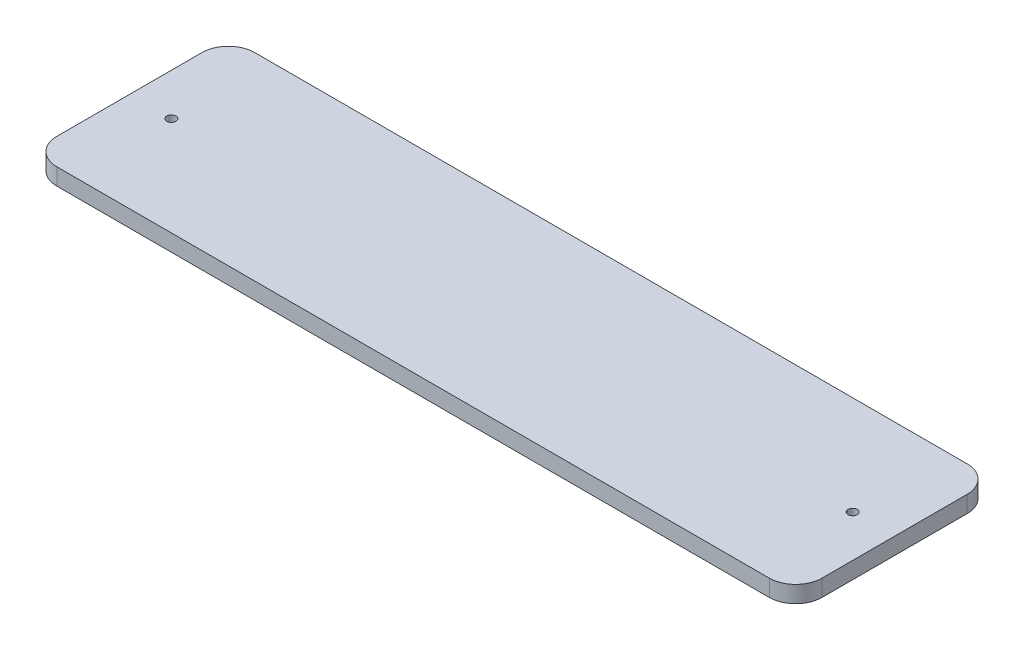
ISO-10303-21;
HEADER;
FILE_DESCRIPTION(('STEP AP214'),'2;1');
FILE_NAME('part.step','',(''),(''),'','','');
FILE_SCHEMA(('AUTOMOTIVE_DESIGN { 1 0 10303 214 1 1 1 1 }'));
ENDSEC;
DATA;
#1=APPLICATION_CONTEXT('core data for automotive mechanical design processes');
#2=APPLICATION_PROTOCOL_DEFINITION('international standard','automotive_design',2000,#1);
#3=PRODUCT_CONTEXT('',#1,'mechanical');
#4=PRODUCT('Part','Part','',(#3));
#5=PRODUCT_RELATED_PRODUCT_CATEGORY('part','',(#4));
#6=PRODUCT_DEFINITION_FORMATION('','',#4);
#7=PRODUCT_DEFINITION_CONTEXT('part definition',#1,'design');
#8=PRODUCT_DEFINITION('design','',#6,#7);
#9=PRODUCT_DEFINITION_SHAPE('','',#8);
#10=(LENGTH_UNIT() NAMED_UNIT(*) SI_UNIT(.MILLI.,.METRE.));
#11=(NAMED_UNIT(*) PLANE_ANGLE_UNIT() SI_UNIT($,.RADIAN.));
#12=(NAMED_UNIT(*) SI_UNIT($,.STERADIAN.) SOLID_ANGLE_UNIT());
#13=UNCERTAINTY_MEASURE_WITH_UNIT(LENGTH_MEASURE(1.E-05),#10,'distance_accuracy_value','');
#14=(GEOMETRIC_REPRESENTATION_CONTEXT(3) GLOBAL_UNCERTAINTY_ASSIGNED_CONTEXT((#13)) GLOBAL_UNIT_ASSIGNED_CONTEXT((#10,
#11,#12)) REPRESENTATION_CONTEXT('',''));
#15=CARTESIAN_POINT('',(0.,0.,0.));
#16=DIRECTION('',(0.,0.,1.));
#17=DIRECTION('',(1.,0.,0.));
#18=AXIS2_PLACEMENT_3D('',#15,#16,#17);
#19=CARTESIAN_POINT('',(145.,6.35,-37.5));
#20=DIRECTION('',(-1.,0.,0.));
#21=DIRECTION('',(0.,0.,1.));
#22=AXIS2_PLACEMENT_3D('',#19,#20,#21);
#23=PLANE('',#22);
#24=DIRECTION('',(0.,0.,-1.));
#25=VECTOR('',#24,1.);
#26=CARTESIAN_POINT('',(145.,0.,-37.5));
#27=LINE('',#26,#25);
#28=CARTESIAN_POINT('',(145.,0.,27.5));
#29=VERTEX_POINT('',#28);
#30=CARTESIAN_POINT('',(145.,0.,-27.5));
#31=VERTEX_POINT('',#30);
#32=EDGE_CURVE('E126',#29,#31,#27,.T.);
#33=ORIENTED_EDGE('',*,*,#32,.T.);
#34=DIRECTION('',(0.,-1.,0.));
#35=VECTOR('',#34,1.);
#36=CARTESIAN_POINT('',(145.,6.35,-27.5));
#37=LINE('',#36,#35);
#38=CARTESIAN_POINT('',(145.,6.35,-27.5));
#39=VERTEX_POINT('',#38);
#40=EDGE_CURVE('E104',#31,#39,#37,.F.);
#41=ORIENTED_EDGE('',*,*,#40,.T.);
#42=DIRECTION('',(0.,0.,-1.));
#43=VECTOR('',#42,1.);
#44=CARTESIAN_POINT('',(145.,6.35,-37.5));
#45=LINE('',#44,#43);
#46=CARTESIAN_POINT('',(145.,6.35,27.5));
#47=VERTEX_POINT('',#46);
#48=EDGE_CURVE('E136',#47,#39,#45,.T.);
#49=ORIENTED_EDGE('',*,*,#48,.F.);
#50=DIRECTION('',(0.,-1.,0.));
#51=VECTOR('',#50,1.);
#52=CARTESIAN_POINT('',(145.,6.35,27.5));
#53=LINE('',#52,#51);
#54=EDGE_CURVE('E109',#47,#29,#53,.T.);
#55=ORIENTED_EDGE('',*,*,#54,.T.);
#56=EDGE_LOOP('',(#33,#41,#49,#55));
#57=FACE_BOUND('',#56,.T.);
#58=ADVANCED_FACE('F33',(#57),#23,.F.);
#59=CARTESIAN_POINT('',(-145.,6.35,-37.5));
#60=DIRECTION('',(0.,0.,1.));
#61=DIRECTION('',(1.,0.,0.));
#62=AXIS2_PLACEMENT_3D('',#59,#60,#61);
#63=PLANE('',#62);
#64=DIRECTION('',(-1.,0.,0.));
#65=VECTOR('',#64,1.);
#66=CARTESIAN_POINT('',(-145.,6.35,-37.5));
#67=LINE('',#66,#65);
#68=CARTESIAN_POINT('',(135.,6.35,-37.5));
#69=VERTEX_POINT('',#68);
#70=CARTESIAN_POINT('',(-135.,6.35,-37.5));
#71=VERTEX_POINT('',#70);
#72=EDGE_CURVE('E119',#69,#71,#67,.T.);
#73=ORIENTED_EDGE('',*,*,#72,.F.);
#74=DIRECTION('',(0.,-1.,0.));
#75=VECTOR('',#74,1.);
#76=CARTESIAN_POINT('',(135.,6.35,-37.5));
#77=LINE('',#76,#75);
#78=CARTESIAN_POINT('',(135.,0.,-37.5));
#79=VERTEX_POINT('',#78);
#80=EDGE_CURVE('E103',#69,#79,#77,.T.);
#81=ORIENTED_EDGE('',*,*,#80,.T.);
#82=DIRECTION('',(-1.,0.,0.));
#83=VECTOR('',#82,1.);
#84=CARTESIAN_POINT('',(-145.,0.,-37.5));
#85=LINE('',#84,#83);
#86=CARTESIAN_POINT('',(-135.,0.,-37.5));
#87=VERTEX_POINT('',#86);
#88=EDGE_CURVE('E116',#79,#87,#85,.T.);
#89=ORIENTED_EDGE('',*,*,#88,.T.);
#90=DIRECTION('',(0.,-1.,0.));
#91=VECTOR('',#90,1.);
#92=CARTESIAN_POINT('',(-135.,6.35,-37.5));
#93=LINE('',#92,#91);
#94=EDGE_CURVE('E121',#87,#71,#93,.F.);
#95=ORIENTED_EDGE('',*,*,#94,.T.);
#96=EDGE_LOOP('',(#73,#81,#89,#95));
#97=FACE_BOUND('',#96,.T.);
#98=ADVANCED_FACE('F115',(#97),#63,.F.);
#99=CARTESIAN_POINT('',(-145.,6.35,-37.5));
#100=DIRECTION('',(1.,0.,0.));
#101=DIRECTION('',(0.,0.,-1.));
#102=AXIS2_PLACEMENT_3D('',#99,#100,#101);
#103=PLANE('',#102);
#104=DIRECTION('',(0.,0.,1.));
#105=VECTOR('',#104,1.);
#106=CARTESIAN_POINT('',(-145.,0.,-37.5));
#107=LINE('',#106,#105);
#108=CARTESIAN_POINT('',(-145.,0.,-27.5));
#109=VERTEX_POINT('',#108);
#110=CARTESIAN_POINT('',(-145.,0.,27.5));
#111=VERTEX_POINT('',#110);
#112=EDGE_CURVE('E125',#109,#111,#107,.T.);
#113=ORIENTED_EDGE('',*,*,#112,.T.);
#114=DIRECTION('',(0.,-1.,0.));
#115=VECTOR('',#114,1.);
#116=CARTESIAN_POINT('',(-145.,6.35,27.5));
#117=LINE('',#116,#115);
#118=CARTESIAN_POINT('',(-145.,6.35,27.5));
#119=VERTEX_POINT('',#118);
#120=EDGE_CURVE('E11',#111,#119,#117,.F.);
#121=ORIENTED_EDGE('',*,*,#120,.T.);
#122=DIRECTION('',(0.,0.,1.));
#123=VECTOR('',#122,1.);
#124=CARTESIAN_POINT('',(-145.,6.35,-37.5));
#125=LINE('',#124,#123);
#126=CARTESIAN_POINT('',(-145.,6.35,-27.5));
#127=VERTEX_POINT('',#126);
#128=EDGE_CURVE('E162',#127,#119,#125,.T.);
#129=ORIENTED_EDGE('',*,*,#128,.F.);
#130=DIRECTION('',(0.,-1.,0.));
#131=VECTOR('',#130,1.);
#132=CARTESIAN_POINT('',(-145.,6.35,-27.5));
#133=LINE('',#132,#131);
#134=EDGE_CURVE('E41',#127,#109,#133,.T.);
#135=ORIENTED_EDGE('',*,*,#134,.T.);
#136=EDGE_LOOP('',(#113,#121,#129,#135));
#137=FACE_BOUND('',#136,.T.);
#138=ADVANCED_FACE('F160',(#137),#103,.F.);
#139=CARTESIAN_POINT('',(-145.,6.35,37.5));
#140=DIRECTION('',(0.,0.,-1.));
#141=DIRECTION('',(-1.,0.,0.));
#142=AXIS2_PLACEMENT_3D('',#139,#140,#141);
#143=PLANE('',#142);
#144=DIRECTION('',(1.,0.,0.));
#145=VECTOR('',#144,1.);
#146=CARTESIAN_POINT('',(-145.,0.,37.5));
#147=LINE('',#146,#145);
#148=CARTESIAN_POINT('',(-135.,0.,37.5));
#149=VERTEX_POINT('',#148);
#150=CARTESIAN_POINT('',(135.,0.,37.5));
#151=VERTEX_POINT('',#150);
#152=EDGE_CURVE('E129',#149,#151,#147,.T.);
#153=ORIENTED_EDGE('',*,*,#152,.T.);
#154=DIRECTION('',(0.,-1.,0.));
#155=VECTOR('',#154,1.);
#156=CARTESIAN_POINT('',(135.,6.35,37.5));
#157=LINE('',#156,#155);
#158=CARTESIAN_POINT('',(135.,6.35,37.5));
#159=VERTEX_POINT('',#158);
#160=EDGE_CURVE('E48',#151,#159,#157,.F.);
#161=ORIENTED_EDGE('',*,*,#160,.T.);
#162=DIRECTION('',(1.,0.,0.));
#163=VECTOR('',#162,1.);
#164=CARTESIAN_POINT('',(-145.,6.35,37.5));
#165=LINE('',#164,#163);
#166=CARTESIAN_POINT('',(-135.,6.35,37.5));
#167=VERTEX_POINT('',#166);
#168=EDGE_CURVE('E137',#167,#159,#165,.T.);
#169=ORIENTED_EDGE('',*,*,#168,.F.);
#170=DIRECTION('',(0.,-1.,0.));
#171=VECTOR('',#170,1.);
#172=CARTESIAN_POINT('',(-135.,6.35,37.5));
#173=LINE('',#172,#171);
#174=EDGE_CURVE('E153',#167,#149,#173,.T.);
#175=ORIENTED_EDGE('',*,*,#174,.T.);
#176=EDGE_LOOP('',(#153,#161,#169,#175));
#177=FACE_BOUND('',#176,.T.);
#178=ADVANCED_FACE('F169',(#177),#143,.F.);
#179=CARTESIAN_POINT('',(0.,6.35,0.));
#180=DIRECTION('',(0.,1.,0.));
#181=DIRECTION('',(0.,0.,1.));
#182=AXIS2_PLACEMENT_3D('',#179,#180,#181);
#183=PLANE('',#182);
#184=CARTESIAN_POINT('',(129.12,6.35,0.));
#185=DIRECTION('',(0.,1.,0.));
#186=DIRECTION('',(0.,0.,1.));
#187=AXIS2_PLACEMENT_3D('',#184,#185,#186);
#188=CIRCLE('',#187,1.75000000000001);
#189=CARTESIAN_POINT('',(129.12,6.35,1.75000000000001));
#190=VERTEX_POINT('',#189);
#191=EDGE_CURVE('E182',#190,#190,#188,.T.);
#192=ORIENTED_EDGE('',*,*,#191,.F.);
#193=EDGE_LOOP('',(#192));
#194=FACE_BOUND('',#193,.T.);
#195=CARTESIAN_POINT('',(-129.12,6.35,0.));
#196=DIRECTION('',(0.,1.,0.));
#197=DIRECTION('',(0.,0.,1.));
#198=AXIS2_PLACEMENT_3D('',#195,#196,#197);
#199=CIRCLE('',#198,1.75000000000001);
#200=CARTESIAN_POINT('',(-129.12,6.35,1.75000000000001));
#201=VERTEX_POINT('',#200);
#202=EDGE_CURVE('E176',#201,#201,#199,.T.);
#203=ORIENTED_EDGE('',*,*,#202,.F.);
#204=EDGE_LOOP('',(#203));
#205=FACE_BOUND('',#204,.T.);
#206=ORIENTED_EDGE('',*,*,#48,.T.);
#207=CARTESIAN_POINT('',(135.,6.35,-27.5));
#208=DIRECTION('',(0.,1.,0.));
#209=DIRECTION('',(0.,0.,1.));
#210=AXIS2_PLACEMENT_3D('',#207,#208,#209);
#211=CIRCLE('',#210,10.);
#212=EDGE_CURVE('E151',#39,#69,#211,.T.);
#213=ORIENTED_EDGE('',*,*,#212,.T.);
#214=ORIENTED_EDGE('',*,*,#72,.T.);
#215=CARTESIAN_POINT('',(-135.,6.35,-27.5));
#216=DIRECTION('',(0.,1.,0.));
#217=DIRECTION('',(0.,0.,1.));
#218=AXIS2_PLACEMENT_3D('',#215,#216,#217);
#219=CIRCLE('',#218,10.);
#220=EDGE_CURVE('E146',#71,#127,#219,.T.);
#221=ORIENTED_EDGE('',*,*,#220,.T.);
#222=ORIENTED_EDGE('',*,*,#128,.T.);
#223=CARTESIAN_POINT('',(-135.,6.35,27.5));
#224=DIRECTION('',(0.,1.,0.));
#225=DIRECTION('',(0.,0.,1.));
#226=AXIS2_PLACEMENT_3D('',#223,#224,#225);
#227=CIRCLE('',#226,10.);
#228=EDGE_CURVE('E55',#119,#167,#227,.T.);
#229=ORIENTED_EDGE('',*,*,#228,.T.);
#230=ORIENTED_EDGE('',*,*,#168,.T.);
#231=CARTESIAN_POINT('',(135.,6.35,27.5));
#232=DIRECTION('',(0.,1.,0.));
#233=DIRECTION('',(0.,0.,1.));
#234=AXIS2_PLACEMENT_3D('',#231,#232,#233);
#235=CIRCLE('',#234,10.);
#236=EDGE_CURVE('E149',#159,#47,#235,.T.);
#237=ORIENTED_EDGE('',*,*,#236,.T.);
#238=EDGE_LOOP('',(#206,#213,#214,#221,#222,#229,#230,#237));
#239=FACE_BOUND('',#238,.T.);
#240=ADVANCED_FACE('F197',(#194,#205,#239),#183,.T.);
#241=CARTESIAN_POINT('',(0.,0.,0.));
#242=DIRECTION('',(0.,1.,0.));
#243=DIRECTION('',(0.,0.,1.));
#244=AXIS2_PLACEMENT_3D('',#241,#242,#243);
#245=PLANE('',#244);
#246=CARTESIAN_POINT('',(129.12,0.,0.));
#247=DIRECTION('',(0.,1.,0.));
#248=DIRECTION('',(0.,0.,1.));
#249=AXIS2_PLACEMENT_3D('',#246,#247,#248);
#250=CIRCLE('',#249,1.75000000000001);
#251=CARTESIAN_POINT('',(129.12,0.,1.75000000000001));
#252=VERTEX_POINT('',#251);
#253=EDGE_CURVE('E179',#252,#252,#250,.T.);
#254=ORIENTED_EDGE('',*,*,#253,.T.);
#255=EDGE_LOOP('',(#254));
#256=FACE_BOUND('',#255,.T.);
#257=CARTESIAN_POINT('',(-129.12,0.,0.));
#258=DIRECTION('',(0.,1.,0.));
#259=DIRECTION('',(0.,0.,1.));
#260=AXIS2_PLACEMENT_3D('',#257,#258,#259);
#261=CIRCLE('',#260,1.75000000000001);
#262=CARTESIAN_POINT('',(-129.12,0.,1.75000000000001));
#263=VERTEX_POINT('',#262);
#264=EDGE_CURVE('E131',#263,#263,#261,.T.);
#265=ORIENTED_EDGE('',*,*,#264,.T.);
#266=EDGE_LOOP('',(#265));
#267=FACE_BOUND('',#266,.T.);
#268=ORIENTED_EDGE('',*,*,#88,.F.);
#269=CARTESIAN_POINT('',(135.,0.,-27.5));
#270=DIRECTION('',(0.,1.,0.));
#271=DIRECTION('',(0.,0.,1.));
#272=AXIS2_PLACEMENT_3D('',#269,#270,#271);
#273=CIRCLE('',#272,10.);
#274=EDGE_CURVE('E99',#79,#31,#273,.F.);
#275=ORIENTED_EDGE('',*,*,#274,.T.);
#276=ORIENTED_EDGE('',*,*,#32,.F.);
#277=CARTESIAN_POINT('',(135.,0.,27.5));
#278=DIRECTION('',(0.,1.,0.));
#279=DIRECTION('',(0.,0.,1.));
#280=AXIS2_PLACEMENT_3D('',#277,#278,#279);
#281=CIRCLE('',#280,10.);
#282=EDGE_CURVE('E110',#29,#151,#281,.F.);
#283=ORIENTED_EDGE('',*,*,#282,.T.);
#284=ORIENTED_EDGE('',*,*,#152,.F.);
#285=CARTESIAN_POINT('',(-135.,0.,27.5));
#286=DIRECTION('',(0.,1.,0.));
#287=DIRECTION('',(0.,0.,1.));
#288=AXIS2_PLACEMENT_3D('',#285,#286,#287);
#289=CIRCLE('',#288,10.);
#290=EDGE_CURVE('E140',#149,#111,#289,.F.);
#291=ORIENTED_EDGE('',*,*,#290,.T.);
#292=ORIENTED_EDGE('',*,*,#112,.F.);
#293=CARTESIAN_POINT('',(-135.,0.,-27.5));
#294=DIRECTION('',(0.,1.,0.));
#295=DIRECTION('',(0.,0.,1.));
#296=AXIS2_PLACEMENT_3D('',#293,#294,#295);
#297=CIRCLE('',#296,10.);
#298=EDGE_CURVE('E120',#109,#87,#297,.F.);
#299=ORIENTED_EDGE('',*,*,#298,.T.);
#300=EDGE_LOOP('',(#268,#275,#276,#283,#284,#291,#292,#299));
#301=FACE_BOUND('',#300,.T.);
#302=ADVANCED_FACE('F123',(#256,#267,#301),#245,.F.);
#303=CARTESIAN_POINT('',(-129.12,0.,0.));
#304=DIRECTION('',(0.,1.,0.));
#305=DIRECTION('',(0.,0.,1.));
#306=AXIS2_PLACEMENT_3D('',#303,#304,#305);
#307=CYLINDRICAL_SURFACE('',#306,1.75000000000001);
#308=ORIENTED_EDGE('',*,*,#264,.F.);
#309=EDGE_LOOP('',(#308));
#310=FACE_BOUND('',#309,.T.);
#311=ORIENTED_EDGE('',*,*,#202,.T.);
#312=EDGE_LOOP('',(#311));
#313=FACE_BOUND('',#312,.T.);
#314=ADVANCED_FACE('F193',(#310,#313),#307,.F.);
#315=CARTESIAN_POINT('',(129.12,0.,0.));
#316=DIRECTION('',(0.,1.,0.));
#317=DIRECTION('',(0.,0.,1.));
#318=AXIS2_PLACEMENT_3D('',#315,#316,#317);
#319=CYLINDRICAL_SURFACE('',#318,1.75000000000001);
#320=ORIENTED_EDGE('',*,*,#253,.F.);
#321=EDGE_LOOP('',(#320));
#322=FACE_BOUND('',#321,.T.);
#323=ORIENTED_EDGE('',*,*,#191,.T.);
#324=EDGE_LOOP('',(#323));
#325=FACE_BOUND('',#324,.T.);
#326=ADVANCED_FACE('F190',(#322,#325),#319,.F.);
#327=CARTESIAN_POINT('',(135.,6.35,-27.5));
#328=DIRECTION('',(0.,-1.,0.));
#329=DIRECTION('',(0.,0.,-1.));
#330=AXIS2_PLACEMENT_3D('',#327,#328,#329);
#331=CYLINDRICAL_SURFACE('',#330,10.);
#332=ORIENTED_EDGE('',*,*,#212,.F.);
#333=ORIENTED_EDGE('',*,*,#40,.F.);
#334=ORIENTED_EDGE('',*,*,#274,.F.);
#335=ORIENTED_EDGE('',*,*,#80,.F.);
#336=EDGE_LOOP('',(#332,#333,#334,#335));
#337=FACE_BOUND('',#336,.T.);
#338=ADVANCED_FACE('F102',(#337),#331,.T.);
#339=CARTESIAN_POINT('',(135.,6.35,27.5));
#340=DIRECTION('',(0.,-1.,0.));
#341=DIRECTION('',(0.,0.,-1.));
#342=AXIS2_PLACEMENT_3D('',#339,#340,#341);
#343=CYLINDRICAL_SURFACE('',#342,10.);
#344=ORIENTED_EDGE('',*,*,#236,.F.);
#345=ORIENTED_EDGE('',*,*,#160,.F.);
#346=ORIENTED_EDGE('',*,*,#282,.F.);
#347=ORIENTED_EDGE('',*,*,#54,.F.);
#348=EDGE_LOOP('',(#344,#345,#346,#347));
#349=FACE_BOUND('',#348,.T.);
#350=ADVANCED_FACE('F206',(#349),#343,.T.);
#351=CARTESIAN_POINT('',(-135.,6.35,27.5));
#352=DIRECTION('',(0.,-1.,0.));
#353=DIRECTION('',(0.,0.,-1.));
#354=AXIS2_PLACEMENT_3D('',#351,#352,#353);
#355=CYLINDRICAL_SURFACE('',#354,10.);
#356=ORIENTED_EDGE('',*,*,#228,.F.);
#357=ORIENTED_EDGE('',*,*,#120,.F.);
#358=ORIENTED_EDGE('',*,*,#290,.F.);
#359=ORIENTED_EDGE('',*,*,#174,.F.);
#360=EDGE_LOOP('',(#356,#357,#358,#359));
#361=FACE_BOUND('',#360,.T.);
#362=ADVANCED_FACE('F168',(#361),#355,.T.);
#363=CARTESIAN_POINT('',(-135.,6.35,-27.5));
#364=DIRECTION('',(0.,-1.,0.));
#365=DIRECTION('',(0.,0.,-1.));
#366=AXIS2_PLACEMENT_3D('',#363,#364,#365);
#367=CYLINDRICAL_SURFACE('',#366,10.);
#368=ORIENTED_EDGE('',*,*,#220,.F.);
#369=ORIENTED_EDGE('',*,*,#94,.F.);
#370=ORIENTED_EDGE('',*,*,#298,.F.);
#371=ORIENTED_EDGE('',*,*,#134,.F.);
#372=EDGE_LOOP('',(#368,#369,#370,#371));
#373=FACE_BOUND('',#372,.T.);
#374=ADVANCED_FACE('F35',(#373),#367,.T.);
#375=CLOSED_SHELL('',(#58,#98,#138,#178,#240,#302,#314,#326,#338,#350,#362,#374));
#376=MANIFOLD_SOLID_BREP('B2',#375);
#377=ADVANCED_BREP_SHAPE_REPRESENTATION('',(#18,#376),#14);
#378=SHAPE_DEFINITION_REPRESENTATION(#9,#377);
ENDSEC;
END-ISO-10303-21;
